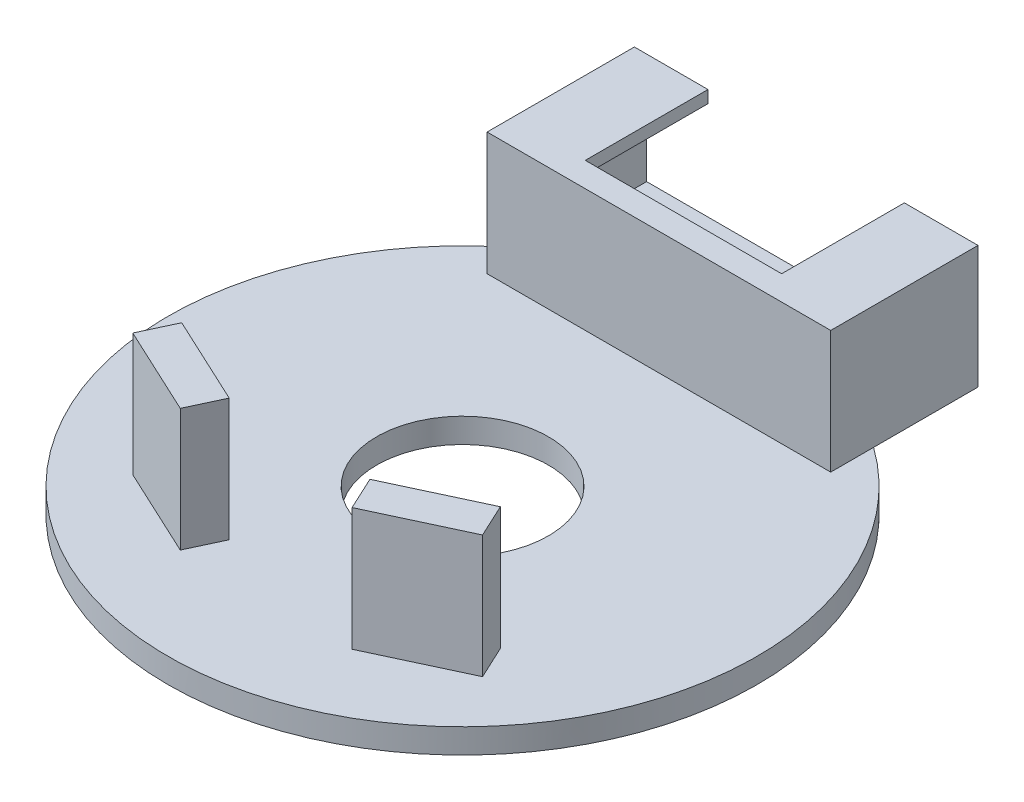
ISO-10303-21;
HEADER;
FILE_DESCRIPTION(('STEP AP214'),'2;1');
FILE_NAME('part.step','',(''),(''),'','','');
FILE_SCHEMA(('AUTOMOTIVE_DESIGN { 1 0 10303 214 1 1 1 1 }'));
ENDSEC;
DATA;
#1=APPLICATION_CONTEXT('core data for automotive mechanical design processes');
#2=APPLICATION_PROTOCOL_DEFINITION('international standard','automotive_design',2000,#1);
#3=PRODUCT_CONTEXT('',#1,'mechanical');
#4=PRODUCT('Part','Part','',(#3));
#5=PRODUCT_RELATED_PRODUCT_CATEGORY('part','',(#4));
#6=PRODUCT_DEFINITION_FORMATION('','',#4);
#7=PRODUCT_DEFINITION_CONTEXT('part definition',#1,'design');
#8=PRODUCT_DEFINITION('design','',#6,#7);
#9=PRODUCT_DEFINITION_SHAPE('','',#8);
#10=(LENGTH_UNIT() NAMED_UNIT(*) SI_UNIT(.MILLI.,.METRE.));
#11=(NAMED_UNIT(*) PLANE_ANGLE_UNIT() SI_UNIT($,.RADIAN.));
#12=(NAMED_UNIT(*) SI_UNIT($,.STERADIAN.) SOLID_ANGLE_UNIT());
#13=UNCERTAINTY_MEASURE_WITH_UNIT(LENGTH_MEASURE(1.E-05),#10,'distance_accuracy_value','');
#14=(GEOMETRIC_REPRESENTATION_CONTEXT(3) GLOBAL_UNCERTAINTY_ASSIGNED_CONTEXT((#13)) GLOBAL_UNIT_ASSIGNED_CONTEXT((#10,
#11,#12)) REPRESENTATION_CONTEXT('',''));
#15=CARTESIAN_POINT('',(0.,0.,0.));
#16=DIRECTION('',(0.,0.,1.));
#17=DIRECTION('',(1.,0.,0.));
#18=AXIS2_PLACEMENT_3D('',#15,#16,#17);
#19=CARTESIAN_POINT('',(0.,0.5,0.));
#20=DIRECTION('',(0.,1.,0.));
#21=DIRECTION('',(0.,0.,1.));
#22=AXIS2_PLACEMENT_3D('',#19,#20,#21);
#23=PLANE('',#22);
#24=DIRECTION('',(0.,0.,1.));
#25=VECTOR('',#24,1.);
#26=CARTESIAN_POINT('',(-7.,0.5,-14.));
#27=LINE('',#26,#25);
#28=CARTESIAN_POINT('',(-7.,0.5,-9.74679434480897));
#29=VERTEX_POINT('',#28);
#30=CARTESIAN_POINT('',(-7.,0.5,-8.));
#31=VERTEX_POINT('',#30);
#32=EDGE_CURVE('E12',#29,#31,#27,.T.);
#33=ORIENTED_EDGE('',*,*,#32,.F.);
#34=CARTESIAN_POINT('',(0.,0.5,0.));
#35=DIRECTION('',(0.,1.,0.));
#36=DIRECTION('',(0.,0.,1.));
#37=AXIS2_PLACEMENT_3D('',#34,#35,#36);
#38=CIRCLE('',#37,12.);
#39=CARTESIAN_POINT('',(7.,0.5,-9.74679434480897));
#40=VERTEX_POINT('',#39);
#41=EDGE_CURVE('E341',#29,#40,#38,.T.);
#42=ORIENTED_EDGE('',*,*,#41,.T.);
#43=DIRECTION('',(0.,0.,-1.));
#44=VECTOR('',#43,1.);
#45=CARTESIAN_POINT('',(7.,0.5,-14.));
#46=LINE('',#45,#44);
#47=CARTESIAN_POINT('',(7.,0.5,-8.));
#48=VERTEX_POINT('',#47);
#49=EDGE_CURVE('E320',#48,#40,#46,.T.);
#50=ORIENTED_EDGE('',*,*,#49,.F.);
#51=DIRECTION('',(1.,0.,0.));
#52=VECTOR('',#51,1.);
#53=CARTESIAN_POINT('',(-7.,0.5,-8.));
#54=LINE('',#53,#52);
#55=EDGE_CURVE('E316',#31,#48,#54,.T.);
#56=ORIENTED_EDGE('',*,*,#55,.F.);
#57=EDGE_LOOP('',(#33,#42,#50,#56));
#58=FACE_BOUND('',#57,.T.);
#59=CARTESIAN_POINT('',(0.,0.5,0.));
#60=DIRECTION('',(0.,1.,0.));
#61=DIRECTION('',(0.,0.,1.));
#62=AXIS2_PLACEMENT_3D('',#59,#60,#61);
#63=CIRCLE('',#62,3.5);
#64=CARTESIAN_POINT('',(0.,0.5,3.5));
#65=VERTEX_POINT('',#64);
#66=EDGE_CURVE('E336',#65,#65,#63,.T.);
#67=ORIENTED_EDGE('',*,*,#66,.F.);
#68=EDGE_LOOP('',(#67));
#69=FACE_BOUND('',#68,.T.);
#70=DIRECTION('',(0.906307787036653,0.,0.422618261740693));
#71=VECTOR('',#70,1.);
#72=CARTESIAN_POINT('',(-3.5,0.5,8.));
#73=LINE('',#72,#71);
#74=CARTESIAN_POINT('',(-7.12523114814661,0.5,6.30952695303723));
#75=VERTEX_POINT('',#74);
#76=CARTESIAN_POINT('',(-3.5,0.5,8.));
#77=VERTEX_POINT('',#76);
#78=EDGE_CURVE('E227',#75,#77,#73,.T.);
#79=ORIENTED_EDGE('',*,*,#78,.F.);
#80=DIRECTION('',(-0.422618261740693,0.,0.906307787036653));
#81=VECTOR('',#80,1.);
#82=CARTESIAN_POINT('',(-7.12523114814661,0.5,6.30952695303723));
#83=LINE('',#82,#81);
#84=CARTESIAN_POINT('',(-6.49130375553557,0.5,4.95006527248225));
#85=VERTEX_POINT('',#84);
#86=EDGE_CURVE('E206',#85,#75,#83,.T.);
#87=ORIENTED_EDGE('',*,*,#86,.F.);
#88=DIRECTION('',(-0.906307787036653,0.,-0.422618261740693));
#89=VECTOR('',#88,1.);
#90=CARTESIAN_POINT('',(-6.49130375553557,0.5,4.95006527248225));
#91=LINE('',#90,#89);
#92=CARTESIAN_POINT('',(-2.86607260738896,0.5,6.64053831944502));
#93=VERTEX_POINT('',#92);
#94=EDGE_CURVE('E220',#93,#85,#91,.T.);
#95=ORIENTED_EDGE('',*,*,#94,.F.);
#96=DIRECTION('',(0.422618261740693,0.,-0.906307787036653));
#97=VECTOR('',#96,1.);
#98=CARTESIAN_POINT('',(-2.86607260738896,0.5,6.64053831944502));
#99=LINE('',#98,#97);
#100=EDGE_CURVE('E64',#77,#93,#99,.T.);
#101=ORIENTED_EDGE('',*,*,#100,.F.);
#102=EDGE_LOOP('',(#79,#87,#95,#101));
#103=FACE_BOUND('',#102,.T.);
#104=DIRECTION('',(-0.422618261740693,0.,-0.906307787036653));
#105=VECTOR('',#104,1.);
#106=CARTESIAN_POINT('',(7.12523114814661,0.5,6.30952695303723));
#107=LINE('',#106,#105);
#108=CARTESIAN_POINT('',(7.12523114814661,0.5,6.30952695303723));
#109=VERTEX_POINT('',#108);
#110=CARTESIAN_POINT('',(6.49130375553557,0.5,4.95006527248225));
#111=VERTEX_POINT('',#110);
#112=EDGE_CURVE('E216',#109,#111,#107,.T.);
#113=ORIENTED_EDGE('',*,*,#112,.F.);
#114=DIRECTION('',(0.906307787036653,0.,-0.422618261740693));
#115=VECTOR('',#114,1.);
#116=CARTESIAN_POINT('',(3.5,0.5,8.));
#117=LINE('',#116,#115);
#118=CARTESIAN_POINT('',(3.5,0.5,8.));
#119=VERTEX_POINT('',#118);
#120=EDGE_CURVE('E210',#119,#109,#117,.T.);
#121=ORIENTED_EDGE('',*,*,#120,.F.);
#122=DIRECTION('',(0.422618261740693,0.,0.906307787036653));
#123=VECTOR('',#122,1.);
#124=CARTESIAN_POINT('',(2.86607260738896,0.5,6.64053831944502));
#125=LINE('',#124,#123);
#126=CARTESIAN_POINT('',(2.86607260738896,0.5,6.64053831944502));
#127=VERTEX_POINT('',#126);
#128=EDGE_CURVE('E190',#127,#119,#125,.T.);
#129=ORIENTED_EDGE('',*,*,#128,.F.);
#130=DIRECTION('',(-0.906307787036653,0.,0.422618261740693));
#131=VECTOR('',#130,1.);
#132=CARTESIAN_POINT('',(6.49130375553557,0.5,4.95006527248225));
#133=LINE('',#132,#131);
#134=EDGE_CURVE('E56',#111,#127,#133,.T.);
#135=ORIENTED_EDGE('',*,*,#134,.F.);
#136=EDGE_LOOP('',(#113,#121,#129,#135));
#137=FACE_BOUND('',#136,.T.);
#138=ADVANCED_FACE('F38',(#58,#69,#103,#137),#23,.T.);
#139=CARTESIAN_POINT('',(6.5,5.,5.60147050873545));
#140=DIRECTION('',(0.,1.,0.));
#141=DIRECTION('',(0.,0.,1.));
#142=AXIS2_PLACEMENT_3D('',#139,#140,#141);
#143=PLANE('',#142);
#144=DIRECTION('',(-1.,0.,0.));
#145=VECTOR('',#144,1.);
#146=CARTESIAN_POINT('',(6.5,5.,-9.));
#147=LINE('',#146,#145);
#148=CARTESIAN_POINT('',(6.5,5.,-9.));
#149=VERTEX_POINT('',#148);
#150=CARTESIAN_POINT('',(4.,5.,-9.));
#151=VERTEX_POINT('',#150);
#152=EDGE_CURVE('E275',#149,#151,#147,.T.);
#153=ORIENTED_EDGE('',*,*,#152,.T.);
#154=DIRECTION('',(0.,0.,-1.));
#155=VECTOR('',#154,1.);
#156=CARTESIAN_POINT('',(4.,5.,5.60147050873545));
#157=LINE('',#156,#155);
#158=CARTESIAN_POINT('',(4.,5.,-14.));
#159=VERTEX_POINT('',#158);
#160=EDGE_CURVE('E267',#151,#159,#157,.T.);
#161=ORIENTED_EDGE('',*,*,#160,.T.);
#162=DIRECTION('',(1.,0.,0.));
#163=VECTOR('',#162,1.);
#164=CARTESIAN_POINT('',(6.5,5.,-14.));
#165=LINE('',#164,#163);
#166=CARTESIAN_POINT('',(6.5,5.,-14.));
#167=VERTEX_POINT('',#166);
#168=EDGE_CURVE('E287',#159,#167,#165,.T.);
#169=ORIENTED_EDGE('',*,*,#168,.T.);
#170=DIRECTION('',(0.,0.,-1.));
#171=VECTOR('',#170,1.);
#172=CARTESIAN_POINT('',(6.5,5.,5.60147050873545));
#173=LINE('',#172,#171);
#174=EDGE_CURVE('E274',#149,#167,#173,.T.);
#175=ORIENTED_EDGE('',*,*,#174,.F.);
#176=EDGE_LOOP('',(#153,#161,#169,#175));
#177=FACE_BOUND('',#176,.T.);
#178=ADVANCED_FACE('F355',(#177),#143,.F.);
#179=CARTESIAN_POINT('',(0.,-0.5,0.));
#180=DIRECTION('',(0.,1.,0.));
#181=DIRECTION('',(0.,0.,1.));
#182=AXIS2_PLACEMENT_3D('',#179,#180,#181);
#183=PLANE('',#182);
#184=CARTESIAN_POINT('',(0.,-0.5,0.));
#185=DIRECTION('',(0.,1.,0.));
#186=DIRECTION('',(0.,0.,1.));
#187=AXIS2_PLACEMENT_3D('',#184,#185,#186);
#188=CIRCLE('',#187,12.);
#189=CARTESIAN_POINT('',(0.,-0.5,12.));
#190=VERTEX_POINT('',#189);
#191=EDGE_CURVE('E42',#190,#190,#188,.T.);
#192=ORIENTED_EDGE('',*,*,#191,.F.);
#193=EDGE_LOOP('',(#192));
#194=FACE_BOUND('',#193,.T.);
#195=CARTESIAN_POINT('',(0.,-0.5,0.));
#196=DIRECTION('',(0.,1.,0.));
#197=DIRECTION('',(0.,0.,1.));
#198=AXIS2_PLACEMENT_3D('',#195,#196,#197);
#199=CIRCLE('',#198,3.5);
#200=CARTESIAN_POINT('',(0.,-0.5,3.5));
#201=VERTEX_POINT('',#200);
#202=EDGE_CURVE('E335',#201,#201,#199,.T.);
#203=ORIENTED_EDGE('',*,*,#202,.T.);
#204=EDGE_LOOP('',(#203));
#205=FACE_BOUND('',#204,.T.);
#206=ADVANCED_FACE('F352',(#194,#205),#183,.F.);
#207=CARTESIAN_POINT('',(0.,0.5,0.));
#208=DIRECTION('',(0.,-1.,0.));
#209=DIRECTION('',(0.,0.,-1.));
#210=AXIS2_PLACEMENT_3D('',#207,#208,#209);
#211=CYLINDRICAL_SURFACE('',#210,12.);
#212=EDGE_CURVE('E47',#40,#29,#38,.T.);
#213=ORIENTED_EDGE('',*,*,#212,.F.);
#214=ORIENTED_EDGE('',*,*,#41,.F.);
#215=EDGE_LOOP('',(#213,#214));
#216=FACE_BOUND('',#215,.T.);
#217=ORIENTED_EDGE('',*,*,#191,.T.);
#218=EDGE_LOOP('',(#217));
#219=FACE_BOUND('',#218,.T.);
#220=ADVANCED_FACE('F40',(#216,#219),#211,.T.);
#221=CARTESIAN_POINT('',(0.,0.5,0.));
#222=DIRECTION('',(0.,-1.,0.));
#223=DIRECTION('',(0.,0.,-1.));
#224=AXIS2_PLACEMENT_3D('',#221,#222,#223);
#225=CYLINDRICAL_SURFACE('',#224,3.5);
#226=ORIENTED_EDGE('',*,*,#66,.T.);
#227=EDGE_LOOP('',(#226));
#228=FACE_BOUND('',#227,.T.);
#229=ORIENTED_EDGE('',*,*,#202,.F.);
#230=EDGE_LOOP('',(#229));
#231=FACE_BOUND('',#230,.T.);
#232=ADVANCED_FACE('F358',(#228,#231),#225,.F.);
#233=CARTESIAN_POINT('',(0.,0.5,0.));
#234=DIRECTION('',(0.,1.,0.));
#235=DIRECTION('',(0.,0.,1.));
#236=AXIS2_PLACEMENT_3D('',#233,#234,#235);
#237=PLANE('',#236);
#238=CARTESIAN_POINT('',(7.,0.5,-14.));
#239=VERTEX_POINT('',#238);
#240=EDGE_CURVE('E319',#40,#239,#46,.T.);
#241=ORIENTED_EDGE('',*,*,#240,.F.);
#242=ORIENTED_EDGE('',*,*,#212,.T.);
#243=CARTESIAN_POINT('',(-7.,0.5,-14.));
#244=VERTEX_POINT('',#243);
#245=EDGE_CURVE('E49',#244,#29,#27,.T.);
#246=ORIENTED_EDGE('',*,*,#245,.F.);
#247=DIRECTION('',(-1.,0.,0.));
#248=VECTOR('',#247,1.);
#249=CARTESIAN_POINT('',(-7.,0.5,-14.));
#250=LINE('',#249,#248);
#251=EDGE_CURVE('E306',#239,#244,#250,.T.);
#252=ORIENTED_EDGE('',*,*,#251,.F.);
#253=EDGE_LOOP('',(#241,#242,#246,#252));
#254=FACE_BOUND('',#253,.T.);
#255=ADVANCED_FACE('F360',(#254),#237,.F.);
#256=CARTESIAN_POINT('',(-7.,5.5,-14.));
#257=DIRECTION('',(1.,0.,0.));
#258=DIRECTION('',(0.,0.,-1.));
#259=AXIS2_PLACEMENT_3D('',#256,#257,#258);
#260=PLANE('',#259);
#261=ORIENTED_EDGE('',*,*,#245,.T.);
#262=ORIENTED_EDGE('',*,*,#32,.T.);
#263=DIRECTION('',(0.,-1.,0.));
#264=VECTOR('',#263,1.);
#265=CARTESIAN_POINT('',(-7.,5.5,-8.));
#266=LINE('',#265,#264);
#267=CARTESIAN_POINT('',(-7.,5.5,-8.));
#268=VERTEX_POINT('',#267);
#269=EDGE_CURVE('E332',#268,#31,#266,.T.);
#270=ORIENTED_EDGE('',*,*,#269,.F.);
#271=DIRECTION('',(0.,0.,1.));
#272=VECTOR('',#271,1.);
#273=CARTESIAN_POINT('',(-7.,5.5,-14.));
#274=LINE('',#273,#272);
#275=CARTESIAN_POINT('',(-7.,5.5,-14.));
#276=VERTEX_POINT('',#275);
#277=EDGE_CURVE('E302',#276,#268,#274,.T.);
#278=ORIENTED_EDGE('',*,*,#277,.F.);
#279=DIRECTION('',(0.,-1.,0.));
#280=VECTOR('',#279,1.);
#281=CARTESIAN_POINT('',(-7.,5.5,-14.));
#282=LINE('',#281,#280);
#283=EDGE_CURVE('E313',#276,#244,#282,.T.);
#284=ORIENTED_EDGE('',*,*,#283,.T.);
#285=EDGE_LOOP('',(#261,#262,#270,#278,#284));
#286=FACE_BOUND('',#285,.T.);
#287=ADVANCED_FACE('F367',(#286),#260,.F.);
#288=CARTESIAN_POINT('',(-7.,5.5,-8.));
#289=DIRECTION('',(0.,0.,-1.));
#290=DIRECTION('',(-1.,0.,0.));
#291=AXIS2_PLACEMENT_3D('',#288,#289,#290);
#292=PLANE('',#291);
#293=ORIENTED_EDGE('',*,*,#55,.T.);
#294=DIRECTION('',(0.,-1.,0.));
#295=VECTOR('',#294,1.);
#296=CARTESIAN_POINT('',(7.,5.5,-8.));
#297=LINE('',#296,#295);
#298=CARTESIAN_POINT('',(7.,5.5,-8.));
#299=VERTEX_POINT('',#298);
#300=EDGE_CURVE('E329',#299,#48,#297,.T.);
#301=ORIENTED_EDGE('',*,*,#300,.F.);
#302=DIRECTION('',(1.,0.,0.));
#303=VECTOR('',#302,1.);
#304=CARTESIAN_POINT('',(-7.,5.5,-8.));
#305=LINE('',#304,#303);
#306=EDGE_CURVE('E305',#268,#299,#305,.T.);
#307=ORIENTED_EDGE('',*,*,#306,.F.);
#308=ORIENTED_EDGE('',*,*,#269,.T.);
#309=EDGE_LOOP('',(#293,#301,#307,#308));
#310=FACE_BOUND('',#309,.T.);
#311=ADVANCED_FACE('F462',(#310),#292,.F.);
#312=CARTESIAN_POINT('',(7.,5.5,-14.));
#313=DIRECTION('',(-1.,0.,0.));
#314=DIRECTION('',(0.,0.,1.));
#315=AXIS2_PLACEMENT_3D('',#312,#313,#314);
#316=PLANE('',#315);
#317=ORIENTED_EDGE('',*,*,#49,.T.);
#318=ORIENTED_EDGE('',*,*,#240,.T.);
#319=DIRECTION('',(0.,-1.,0.));
#320=VECTOR('',#319,1.);
#321=CARTESIAN_POINT('',(7.,5.5,-14.));
#322=LINE('',#321,#320);
#323=CARTESIAN_POINT('',(7.,5.5,-14.));
#324=VERTEX_POINT('',#323);
#325=EDGE_CURVE('E326',#324,#239,#322,.T.);
#326=ORIENTED_EDGE('',*,*,#325,.F.);
#327=DIRECTION('',(0.,0.,-1.));
#328=VECTOR('',#327,1.);
#329=CARTESIAN_POINT('',(7.,5.5,-14.));
#330=LINE('',#329,#328);
#331=EDGE_CURVE('E308',#299,#324,#330,.T.);
#332=ORIENTED_EDGE('',*,*,#331,.F.);
#333=ORIENTED_EDGE('',*,*,#300,.T.);
#334=EDGE_LOOP('',(#317,#318,#326,#332,#333));
#335=FACE_BOUND('',#334,.T.);
#336=ADVANCED_FACE('F458',(#335),#316,.F.);
#337=CARTESIAN_POINT('',(-7.,5.5,-14.));
#338=DIRECTION('',(0.,0.,1.));
#339=DIRECTION('',(1.,0.,0.));
#340=AXIS2_PLACEMENT_3D('',#337,#338,#339);
#341=PLANE('',#340);
#342=ORIENTED_EDGE('',*,*,#168,.F.);
#343=DIRECTION('',(0.,1.,0.));
#344=VECTOR('',#343,1.);
#345=CARTESIAN_POINT('',(4.,-8.4339811320566,-14.));
#346=LINE('',#345,#344);
#347=CARTESIAN_POINT('',(4.,5.5,-14.));
#348=VERTEX_POINT('',#347);
#349=EDGE_CURVE('E259',#159,#348,#346,.T.);
#350=ORIENTED_EDGE('',*,*,#349,.T.);
#351=DIRECTION('',(-1.,0.,0.));
#352=VECTOR('',#351,1.);
#353=CARTESIAN_POINT('',(-7.,5.5,-14.));
#354=LINE('',#353,#352);
#355=EDGE_CURVE('E311',#324,#348,#354,.T.);
#356=ORIENTED_EDGE('',*,*,#355,.F.);
#357=ORIENTED_EDGE('',*,*,#325,.T.);
#358=ORIENTED_EDGE('',*,*,#251,.T.);
#359=ORIENTED_EDGE('',*,*,#283,.F.);
#360=CARTESIAN_POINT('',(-4.,5.5,-14.));
#361=VERTEX_POINT('',#360);
#362=EDGE_CURVE('E310',#361,#276,#354,.T.);
#363=ORIENTED_EDGE('',*,*,#362,.F.);
#364=DIRECTION('',(0.,1.,0.));
#365=VECTOR('',#364,1.);
#366=CARTESIAN_POINT('',(-4.,-8.4339811320566,-14.));
#367=LINE('',#366,#365);
#368=CARTESIAN_POINT('',(-4.,5.,-14.));
#369=VERTEX_POINT('',#368);
#370=EDGE_CURVE('E256',#369,#361,#367,.T.);
#371=ORIENTED_EDGE('',*,*,#370,.F.);
#372=CARTESIAN_POINT('',(-6.5,5.,-14.));
#373=VERTEX_POINT('',#372);
#374=EDGE_CURVE('E288',#373,#369,#165,.T.);
#375=ORIENTED_EDGE('',*,*,#374,.F.);
#376=DIRECTION('',(0.,1.,0.));
#377=VECTOR('',#376,1.);
#378=CARTESIAN_POINT('',(-6.5,5.,-14.));
#379=LINE('',#378,#377);
#380=CARTESIAN_POINT('',(-6.5,1.,-14.));
#381=VERTEX_POINT('',#380);
#382=EDGE_CURVE('E284',#381,#373,#379,.T.);
#383=ORIENTED_EDGE('',*,*,#382,.F.);
#384=DIRECTION('',(-1.,0.,0.));
#385=VECTOR('',#384,1.);
#386=CARTESIAN_POINT('',(6.5,1.,-14.));
#387=LINE('',#386,#385);
#388=CARTESIAN_POINT('',(6.5,1.,-14.));
#389=VERTEX_POINT('',#388);
#390=EDGE_CURVE('E282',#389,#381,#387,.T.);
#391=ORIENTED_EDGE('',*,*,#390,.F.);
#392=DIRECTION('',(0.,-1.,0.));
#393=VECTOR('',#392,1.);
#394=CARTESIAN_POINT('',(6.5,5.,-14.));
#395=LINE('',#394,#393);
#396=EDGE_CURVE('E270',#167,#389,#395,.T.);
#397=ORIENTED_EDGE('',*,*,#396,.F.);
#398=EDGE_LOOP('',(#342,#350,#356,#357,#358,#359,#363,#371,#375,#383,#391,#397));
#399=FACE_BOUND('',#398,.T.);
#400=ADVANCED_FACE('F453',(#399),#341,.F.);
#401=CARTESIAN_POINT('',(0.,5.5,0.));
#402=DIRECTION('',(0.,1.,0.));
#403=DIRECTION('',(0.,0.,1.));
#404=AXIS2_PLACEMENT_3D('',#401,#402,#403);
#405=PLANE('',#404);
#406=DIRECTION('',(0.,0.,-1.));
#407=VECTOR('',#406,1.);
#408=CARTESIAN_POINT('',(4.,5.5,-14.));
#409=LINE('',#408,#407);
#410=CARTESIAN_POINT('',(4.,5.5,-9.));
#411=VERTEX_POINT('',#410);
#412=EDGE_CURVE('E248',#411,#348,#409,.T.);
#413=ORIENTED_EDGE('',*,*,#412,.F.);
#414=DIRECTION('',(1.,0.,0.));
#415=VECTOR('',#414,1.);
#416=CARTESIAN_POINT('',(-4.,5.5,-9.));
#417=LINE('',#416,#415);
#418=CARTESIAN_POINT('',(-4.,5.5,-9.));
#419=VERTEX_POINT('',#418);
#420=EDGE_CURVE('E251',#419,#411,#417,.T.);
#421=ORIENTED_EDGE('',*,*,#420,.F.);
#422=DIRECTION('',(0.,0.,1.));
#423=VECTOR('',#422,1.);
#424=CARTESIAN_POINT('',(-4.,5.5,-14.));
#425=LINE('',#424,#423);
#426=EDGE_CURVE('E236',#361,#419,#425,.T.);
#427=ORIENTED_EDGE('',*,*,#426,.F.);
#428=ORIENTED_EDGE('',*,*,#362,.T.);
#429=ORIENTED_EDGE('',*,*,#277,.T.);
#430=ORIENTED_EDGE('',*,*,#306,.T.);
#431=ORIENTED_EDGE('',*,*,#331,.T.);
#432=ORIENTED_EDGE('',*,*,#355,.T.);
#433=EDGE_LOOP('',(#413,#421,#427,#428,#429,#430,#431,#432));
#434=FACE_BOUND('',#433,.T.);
#435=ADVANCED_FACE('F450',(#434),#405,.T.);
#436=CARTESIAN_POINT('',(6.5,5.,5.60147050873545));
#437=DIRECTION('',(1.,0.,0.));
#438=DIRECTION('',(0.,1.,0.));
#439=AXIS2_PLACEMENT_3D('',#436,#437,#438);
#440=PLANE('',#439);
#441=DIRECTION('',(0.,1.,0.));
#442=VECTOR('',#441,1.);
#443=CARTESIAN_POINT('',(6.5,5.,-9.));
#444=LINE('',#443,#442);
#445=CARTESIAN_POINT('',(6.5,1.,-9.));
#446=VERTEX_POINT('',#445);
#447=EDGE_CURVE('E278',#446,#149,#444,.T.);
#448=ORIENTED_EDGE('',*,*,#447,.T.);
#449=ORIENTED_EDGE('',*,*,#174,.T.);
#450=ORIENTED_EDGE('',*,*,#396,.T.);
#451=DIRECTION('',(0.,0.,-1.));
#452=VECTOR('',#451,1.);
#453=CARTESIAN_POINT('',(6.5,1.,5.60147050873545));
#454=LINE('',#453,#452);
#455=EDGE_CURVE('E291',#446,#389,#454,.T.);
#456=ORIENTED_EDGE('',*,*,#455,.F.);
#457=EDGE_LOOP('',(#448,#449,#450,#456));
#458=FACE_BOUND('',#457,.T.);
#459=ADVANCED_FACE('F440',(#458),#440,.F.);
#460=ORIENTED_EDGE('',*,*,#374,.T.);
#461=DIRECTION('',(0.,0.,1.));
#462=VECTOR('',#461,1.);
#463=CARTESIAN_POINT('',(-4.,5.,5.60147050873545));
#464=LINE('',#463,#462);
#465=CARTESIAN_POINT('',(-4.,5.,-9.));
#466=VERTEX_POINT('',#465);
#467=EDGE_CURVE('E264',#369,#466,#464,.T.);
#468=ORIENTED_EDGE('',*,*,#467,.T.);
#469=CARTESIAN_POINT('',(-6.5,5.,-9.));
#470=VERTEX_POINT('',#469);
#471=EDGE_CURVE('E273',#466,#470,#147,.T.);
#472=ORIENTED_EDGE('',*,*,#471,.T.);
#473=DIRECTION('',(0.,0.,-1.));
#474=VECTOR('',#473,1.);
#475=CARTESIAN_POINT('',(-6.5,5.,5.60147050873545));
#476=LINE('',#475,#474);
#477=EDGE_CURVE('E294',#470,#373,#476,.T.);
#478=ORIENTED_EDGE('',*,*,#477,.T.);
#479=EDGE_LOOP('',(#460,#468,#472,#478));
#480=FACE_BOUND('',#479,.T.);
#481=ADVANCED_FACE('F378',(#480),#143,.F.);
#482=CARTESIAN_POINT('',(-6.5,5.,5.60147050873545));
#483=DIRECTION('',(-1.,0.,0.));
#484=DIRECTION('',(0.,-1.,0.));
#485=AXIS2_PLACEMENT_3D('',#482,#483,#484);
#486=PLANE('',#485);
#487=DIRECTION('',(0.,-1.,0.));
#488=VECTOR('',#487,1.);
#489=CARTESIAN_POINT('',(-6.5,5.,-9.));
#490=LINE('',#489,#488);
#491=CARTESIAN_POINT('',(-6.5,1.,-9.));
#492=VERTEX_POINT('',#491);
#493=EDGE_CURVE('E271',#470,#492,#490,.T.);
#494=ORIENTED_EDGE('',*,*,#493,.T.);
#495=DIRECTION('',(0.,0.,-1.));
#496=VECTOR('',#495,1.);
#497=CARTESIAN_POINT('',(-6.5,1.,5.60147050873545));
#498=LINE('',#497,#496);
#499=EDGE_CURVE('E296',#492,#381,#498,.T.);
#500=ORIENTED_EDGE('',*,*,#499,.T.);
#501=ORIENTED_EDGE('',*,*,#382,.T.);
#502=ORIENTED_EDGE('',*,*,#477,.F.);
#503=EDGE_LOOP('',(#494,#500,#501,#502));
#504=FACE_BOUND('',#503,.T.);
#505=ADVANCED_FACE('F439',(#504),#486,.F.);
#506=CARTESIAN_POINT('',(6.5,1.,5.60147050873545));
#507=DIRECTION('',(0.,-1.,0.));
#508=DIRECTION('',(0.,0.,-1.));
#509=AXIS2_PLACEMENT_3D('',#506,#507,#508);
#510=PLANE('',#509);
#511=DIRECTION('',(1.,0.,0.));
#512=VECTOR('',#511,1.);
#513=CARTESIAN_POINT('',(6.5,1.,-9.));
#514=LINE('',#513,#512);
#515=EDGE_CURVE('E280',#492,#446,#514,.T.);
#516=ORIENTED_EDGE('',*,*,#515,.T.);
#517=ORIENTED_EDGE('',*,*,#455,.T.);
#518=ORIENTED_EDGE('',*,*,#390,.T.);
#519=ORIENTED_EDGE('',*,*,#499,.F.);
#520=EDGE_LOOP('',(#516,#517,#518,#519));
#521=FACE_BOUND('',#520,.T.);
#522=ADVANCED_FACE('F435',(#521),#510,.F.);
#523=CARTESIAN_POINT('',(-7.,5.5,-9.));
#524=DIRECTION('',(0.,0.,-1.));
#525=DIRECTION('',(-1.,0.,0.));
#526=AXIS2_PLACEMENT_3D('',#523,#524,#525);
#527=PLANE('',#526);
#528=ORIENTED_EDGE('',*,*,#471,.F.);
#529=DIRECTION('',(0.,1.,0.));
#530=VECTOR('',#529,1.);
#531=CARTESIAN_POINT('',(-4.,-8.4339811320566,-9.));
#532=LINE('',#531,#530);
#533=EDGE_CURVE('E258',#466,#419,#532,.T.);
#534=ORIENTED_EDGE('',*,*,#533,.T.);
#535=ORIENTED_EDGE('',*,*,#420,.T.);
#536=DIRECTION('',(0.,1.,0.));
#537=VECTOR('',#536,1.);
#538=CARTESIAN_POINT('',(4.,-8.4339811320566,-9.));
#539=LINE('',#538,#537);
#540=EDGE_CURVE('E250',#151,#411,#539,.T.);
#541=ORIENTED_EDGE('',*,*,#540,.F.);
#542=ORIENTED_EDGE('',*,*,#152,.F.);
#543=ORIENTED_EDGE('',*,*,#447,.F.);
#544=ORIENTED_EDGE('',*,*,#515,.F.);
#545=ORIENTED_EDGE('',*,*,#493,.F.);
#546=EDGE_LOOP('',(#528,#534,#535,#541,#542,#543,#544,#545));
#547=FACE_BOUND('',#546,.T.);
#548=ADVANCED_FACE('F432',(#547),#527,.T.);
#549=CARTESIAN_POINT('',(4.,-8.4339811320566,-14.));
#550=DIRECTION('',(1.,0.,0.));
#551=DIRECTION('',(0.,0.,-1.));
#552=AXIS2_PLACEMENT_3D('',#549,#550,#551);
#553=PLANE('',#552);
#554=ORIENTED_EDGE('',*,*,#540,.T.);
#555=ORIENTED_EDGE('',*,*,#412,.T.);
#556=ORIENTED_EDGE('',*,*,#349,.F.);
#557=ORIENTED_EDGE('',*,*,#160,.F.);
#558=EDGE_LOOP('',(#554,#555,#556,#557));
#559=FACE_BOUND('',#558,.T.);
#560=ADVANCED_FACE('F428',(#559),#553,.F.);
#561=CARTESIAN_POINT('',(-4.,-8.4339811320566,-14.));
#562=DIRECTION('',(-1.,0.,0.));
#563=DIRECTION('',(0.,0.,1.));
#564=AXIS2_PLACEMENT_3D('',#561,#562,#563);
#565=PLANE('',#564);
#566=ORIENTED_EDGE('',*,*,#370,.T.);
#567=ORIENTED_EDGE('',*,*,#426,.T.);
#568=ORIENTED_EDGE('',*,*,#533,.F.);
#569=ORIENTED_EDGE('',*,*,#467,.F.);
#570=EDGE_LOOP('',(#566,#567,#568,#569));
#571=FACE_BOUND('',#570,.T.);
#572=ADVANCED_FACE('F423',(#571),#565,.F.);
#573=CARTESIAN_POINT('',(-7.12523114814661,10.7385621421749,6.30952695303723));
#574=DIRECTION('',(0.906307787036653,0.,0.422618261740693));
#575=DIRECTION('',(0.422618261740693,0.,-0.906307787036653));
#576=AXIS2_PLACEMENT_3D('',#573,#574,#575);
#577=PLANE('',#576);
#578=DIRECTION('',(-0.422618261740693,0.,0.906307787036653));
#579=VECTOR('',#578,1.);
#580=CARTESIAN_POINT('',(-7.12523114814661,5.5,6.30952695303723));
#581=LINE('',#580,#579);
#582=CARTESIAN_POINT('',(-6.49130375553557,5.5,4.95006527248225));
#583=VERTEX_POINT('',#582);
#584=CARTESIAN_POINT('',(-7.12523114814661,5.5,6.30952695303723));
#585=VERTEX_POINT('',#584);
#586=EDGE_CURVE('E240',#583,#585,#581,.T.);
#587=ORIENTED_EDGE('',*,*,#586,.F.);
#588=DIRECTION('',(0.,-1.,0.));
#589=VECTOR('',#588,1.);
#590=CARTESIAN_POINT('',(-6.49130375553557,10.7385621421749,4.95006527248225));
#591=LINE('',#590,#589);
#592=EDGE_CURVE('E204',#583,#85,#591,.T.);
#593=ORIENTED_EDGE('',*,*,#592,.T.);
#594=ORIENTED_EDGE('',*,*,#86,.T.);
#595=DIRECTION('',(0.,-1.,0.));
#596=VECTOR('',#595,1.);
#597=CARTESIAN_POINT('',(-7.12523114814661,10.7385621421749,6.30952695303723));
#598=LINE('',#597,#596);
#599=EDGE_CURVE('E230',#585,#75,#598,.T.);
#600=ORIENTED_EDGE('',*,*,#599,.F.);
#601=EDGE_LOOP('',(#587,#593,#594,#600));
#602=FACE_BOUND('',#601,.T.);
#603=ADVANCED_FACE('F420',(#602),#577,.F.);
#604=CARTESIAN_POINT('',(-3.5,10.7385621421749,8.));
#605=DIRECTION('',(0.422618261740693,0.,-0.906307787036653));
#606=DIRECTION('',(-0.906307787036653,0.,-0.422618261740694));
#607=AXIS2_PLACEMENT_3D('',#604,#605,#606);
#608=PLANE('',#607);
#609=DIRECTION('',(0.906307787036653,0.,0.422618261740694));
#610=VECTOR('',#609,1.);
#611=CARTESIAN_POINT('',(-3.5,5.5,8.));
#612=LINE('',#611,#610);
#613=CARTESIAN_POINT('',(-3.5,5.5,8.));
#614=VERTEX_POINT('',#613);
#615=EDGE_CURVE('E237',#585,#614,#612,.T.);
#616=ORIENTED_EDGE('',*,*,#615,.F.);
#617=ORIENTED_EDGE('',*,*,#599,.T.);
#618=ORIENTED_EDGE('',*,*,#78,.T.);
#619=DIRECTION('',(0.,-1.,0.));
#620=VECTOR('',#619,1.);
#621=CARTESIAN_POINT('',(-3.5,10.7385621421749,8.));
#622=LINE('',#621,#620);
#623=EDGE_CURVE('E226',#614,#77,#622,.T.);
#624=ORIENTED_EDGE('',*,*,#623,.F.);
#625=EDGE_LOOP('',(#616,#617,#618,#624));
#626=FACE_BOUND('',#625,.T.);
#627=ADVANCED_FACE('F417',(#626),#608,.F.);
#628=CARTESIAN_POINT('',(-2.86607260738896,10.7385621421749,6.64053831944502));
#629=DIRECTION('',(-0.906307787036653,0.,-0.422618261740693));
#630=DIRECTION('',(-0.422618261740694,0.,0.906307787036653));
#631=AXIS2_PLACEMENT_3D('',#628,#629,#630);
#632=PLANE('',#631);
#633=DIRECTION('',(0.422618261740694,0.,-0.906307787036653));
#634=VECTOR('',#633,1.);
#635=CARTESIAN_POINT('',(-2.86607260738896,5.5,6.64053831944502));
#636=LINE('',#635,#634);
#637=CARTESIAN_POINT('',(-2.86607260738896,5.5,6.64053831944502));
#638=VERTEX_POINT('',#637);
#639=EDGE_CURVE('E233',#614,#638,#636,.T.);
#640=ORIENTED_EDGE('',*,*,#639,.F.);
#641=ORIENTED_EDGE('',*,*,#623,.T.);
#642=ORIENTED_EDGE('',*,*,#100,.T.);
#643=DIRECTION('',(0.,-1.,0.));
#644=VECTOR('',#643,1.);
#645=CARTESIAN_POINT('',(-2.86607260738896,10.7385621421749,6.64053831944502));
#646=LINE('',#645,#644);
#647=EDGE_CURVE('E224',#638,#93,#646,.T.);
#648=ORIENTED_EDGE('',*,*,#647,.F.);
#649=EDGE_LOOP('',(#640,#641,#642,#648));
#650=FACE_BOUND('',#649,.T.);
#651=ADVANCED_FACE('F413',(#650),#632,.F.);
#652=CARTESIAN_POINT('',(-6.49130375553557,10.7385621421749,4.95006527248225));
#653=DIRECTION('',(-0.422618261740693,0.,0.906307787036653));
#654=DIRECTION('',(0.906307787036653,0.,0.422618261740693));
#655=AXIS2_PLACEMENT_3D('',#652,#653,#654);
#656=PLANE('',#655);
#657=DIRECTION('',(-0.906307787036653,0.,-0.422618261740693));
#658=VECTOR('',#657,1.);
#659=CARTESIAN_POINT('',(-6.49130375553557,5.5,4.95006527248225));
#660=LINE('',#659,#658);
#661=EDGE_CURVE('E223',#638,#583,#660,.T.);
#662=ORIENTED_EDGE('',*,*,#661,.F.);
#663=ORIENTED_EDGE('',*,*,#647,.T.);
#664=ORIENTED_EDGE('',*,*,#94,.T.);
#665=ORIENTED_EDGE('',*,*,#592,.F.);
#666=EDGE_LOOP('',(#662,#663,#664,#665));
#667=FACE_BOUND('',#666,.T.);
#668=ADVANCED_FACE('F404',(#667),#656,.F.);
#669=CARTESIAN_POINT('',(0.,5.5,0.));
#670=DIRECTION('',(0.,1.,0.));
#671=DIRECTION('',(0.,0.,1.));
#672=AXIS2_PLACEMENT_3D('',#669,#670,#671);
#673=PLANE('',#672);
#674=ORIENTED_EDGE('',*,*,#661,.T.);
#675=ORIENTED_EDGE('',*,*,#586,.T.);
#676=ORIENTED_EDGE('',*,*,#615,.T.);
#677=ORIENTED_EDGE('',*,*,#639,.T.);
#678=EDGE_LOOP('',(#674,#675,#676,#677));
#679=FACE_BOUND('',#678,.T.);
#680=ADVANCED_FACE('F397',(#679),#673,.T.);
#681=CARTESIAN_POINT('',(3.5,10.7385621421749,8.));
#682=DIRECTION('',(-0.422618261740693,0.,-0.906307787036653));
#683=DIRECTION('',(-0.906307787036653,0.,0.422618261740694));
#684=AXIS2_PLACEMENT_3D('',#681,#682,#683);
#685=PLANE('',#684);
#686=DIRECTION('',(0.906307787036653,0.,-0.422618261740694));
#687=VECTOR('',#686,1.);
#688=CARTESIAN_POINT('',(3.5,5.5,8.));
#689=LINE('',#688,#687);
#690=CARTESIAN_POINT('',(3.5,5.5,8.));
#691=VERTEX_POINT('',#690);
#692=CARTESIAN_POINT('',(7.12523114814661,5.5,6.30952695303723));
#693=VERTEX_POINT('',#692);
#694=EDGE_CURVE('E199',#691,#693,#689,.T.);
#695=ORIENTED_EDGE('',*,*,#694,.F.);
#696=DIRECTION('',(0.,-1.,0.));
#697=VECTOR('',#696,1.);
#698=CARTESIAN_POINT('',(3.5,10.7385621421749,8.));
#699=LINE('',#698,#697);
#700=EDGE_CURVE('E195',#691,#119,#699,.T.);
#701=ORIENTED_EDGE('',*,*,#700,.T.);
#702=ORIENTED_EDGE('',*,*,#120,.T.);
#703=DIRECTION('',(0.,-1.,0.));
#704=VECTOR('',#703,1.);
#705=CARTESIAN_POINT('',(7.12523114814661,10.7385621421749,6.30952695303723));
#706=LINE('',#705,#704);
#707=EDGE_CURVE('E214',#693,#109,#706,.T.);
#708=ORIENTED_EDGE('',*,*,#707,.F.);
#709=EDGE_LOOP('',(#695,#701,#702,#708));
#710=FACE_BOUND('',#709,.T.);
#711=ADVANCED_FACE('F395',(#710),#685,.F.);
#712=CARTESIAN_POINT('',(7.12523114814661,10.7385621421749,6.30952695303723));
#713=DIRECTION('',(-0.906307787036653,0.,0.422618261740693));
#714=DIRECTION('',(0.422618261740693,0.,0.906307787036653));
#715=AXIS2_PLACEMENT_3D('',#712,#713,#714);
#716=PLANE('',#715);
#717=DIRECTION('',(-0.422618261740693,0.,-0.906307787036653));
#718=VECTOR('',#717,1.);
#719=CARTESIAN_POINT('',(7.12523114814661,5.5,6.30952695303723));
#720=LINE('',#719,#718);
#721=CARTESIAN_POINT('',(6.49130375553557,5.5,4.95006527248225));
#722=VERTEX_POINT('',#721);
#723=EDGE_CURVE('E203',#693,#722,#720,.T.);
#724=ORIENTED_EDGE('',*,*,#723,.F.);
#725=ORIENTED_EDGE('',*,*,#707,.T.);
#726=ORIENTED_EDGE('',*,*,#112,.T.);
#727=DIRECTION('',(0.,-1.,0.));
#728=VECTOR('',#727,1.);
#729=CARTESIAN_POINT('',(6.49130375553557,10.7385621421749,4.95006527248225));
#730=LINE('',#729,#728);
#731=EDGE_CURVE('E217',#722,#111,#730,.T.);
#732=ORIENTED_EDGE('',*,*,#731,.F.);
#733=EDGE_LOOP('',(#724,#725,#726,#732));
#734=FACE_BOUND('',#733,.T.);
#735=ADVANCED_FACE('F392',(#734),#716,.F.);
#736=CARTESIAN_POINT('',(6.49130375553557,10.7385621421749,4.95006527248225));
#737=DIRECTION('',(0.422618261740693,0.,0.906307787036653));
#738=DIRECTION('',(0.906307787036653,0.,-0.422618261740693));
#739=AXIS2_PLACEMENT_3D('',#736,#737,#738);
#740=PLANE('',#739);
#741=DIRECTION('',(-0.906307787036653,0.,0.422618261740693));
#742=VECTOR('',#741,1.);
#743=CARTESIAN_POINT('',(6.49130375553557,5.5,4.95006527248225));
#744=LINE('',#743,#742);
#745=CARTESIAN_POINT('',(2.86607260738896,5.5,6.64053831944502));
#746=VERTEX_POINT('',#745);
#747=EDGE_CURVE('E185',#722,#746,#744,.T.);
#748=ORIENTED_EDGE('',*,*,#747,.F.);
#749=ORIENTED_EDGE('',*,*,#731,.T.);
#750=ORIENTED_EDGE('',*,*,#134,.T.);
#751=DIRECTION('',(0.,-1.,0.));
#752=VECTOR('',#751,1.);
#753=CARTESIAN_POINT('',(2.86607260738896,10.7385621421749,6.64053831944502));
#754=LINE('',#753,#752);
#755=EDGE_CURVE('E181',#746,#127,#754,.T.);
#756=ORIENTED_EDGE('',*,*,#755,.F.);
#757=EDGE_LOOP('',(#748,#749,#750,#756));
#758=FACE_BOUND('',#757,.T.);
#759=ADVANCED_FACE('F183',(#758),#740,.F.);
#760=CARTESIAN_POINT('',(2.86607260738896,10.7385621421749,6.64053831944502));
#761=DIRECTION('',(0.906307787036653,0.,-0.422618261740693));
#762=DIRECTION('',(-0.422618261740694,0.,-0.906307787036653));
#763=AXIS2_PLACEMENT_3D('',#760,#761,#762);
#764=PLANE('',#763);
#765=DIRECTION('',(0.422618261740694,0.,0.906307787036653));
#766=VECTOR('',#765,1.);
#767=CARTESIAN_POINT('',(2.86607260738896,5.5,6.64053831944502));
#768=LINE('',#767,#766);
#769=EDGE_CURVE('E193',#746,#691,#768,.T.);
#770=ORIENTED_EDGE('',*,*,#769,.F.);
#771=ORIENTED_EDGE('',*,*,#755,.T.);
#772=ORIENTED_EDGE('',*,*,#128,.T.);
#773=ORIENTED_EDGE('',*,*,#700,.F.);
#774=EDGE_LOOP('',(#770,#771,#772,#773));
#775=FACE_BOUND('',#774,.T.);
#776=ADVANCED_FACE('F194',(#775),#764,.F.);
#777=CARTESIAN_POINT('',(0.,5.5,0.));
#778=DIRECTION('',(0.,1.,0.));
#779=DIRECTION('',(0.,0.,1.));
#780=AXIS2_PLACEMENT_3D('',#777,#778,#779);
#781=PLANE('',#780);
#782=ORIENTED_EDGE('',*,*,#769,.T.);
#783=ORIENTED_EDGE('',*,*,#694,.T.);
#784=ORIENTED_EDGE('',*,*,#723,.T.);
#785=ORIENTED_EDGE('',*,*,#747,.T.);
#786=EDGE_LOOP('',(#782,#783,#784,#785));
#787=FACE_BOUND('',#786,.T.);
#788=ADVANCED_FACE('F202',(#787),#781,.T.);
#789=CLOSED_SHELL('',(#138,#178,#206,#220,#232,#255,#287,#311,#336,#400,#435,#459,#481,#505,
#522,#548,#560,#572,#603,#627,#651,#668,#680,#711,#735,#759,#776,#788));
#790=MANIFOLD_SOLID_BREP('B2',#789);
#791=ADVANCED_BREP_SHAPE_REPRESENTATION('',(#18,#790),#14);
#792=SHAPE_DEFINITION_REPRESENTATION(#9,#791);
ENDSEC;
END-ISO-10303-21;
